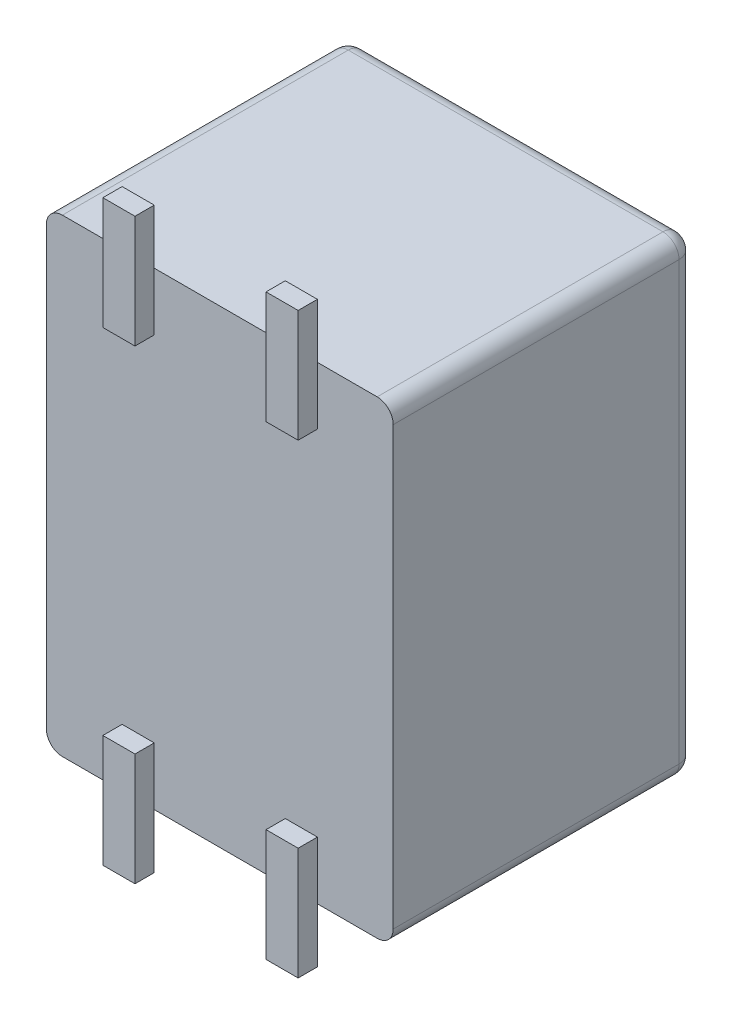
ISO-10303-21;
HEADER;
FILE_DESCRIPTION(('STEP AP214'),'2;1');
FILE_NAME('part.step','',(''),(''),'','','');
FILE_SCHEMA(('AUTOMOTIVE_DESIGN { 1 0 10303 214 1 1 1 1 }'));
ENDSEC;
DATA;
#1=APPLICATION_CONTEXT('core data for automotive mechanical design processes');
#2=APPLICATION_PROTOCOL_DEFINITION('international standard','automotive_design',2000,#1);
#3=PRODUCT_CONTEXT('',#1,'mechanical');
#4=PRODUCT('Part','Part','',(#3));
#5=PRODUCT_RELATED_PRODUCT_CATEGORY('part','',(#4));
#6=PRODUCT_DEFINITION_FORMATION('','',#4);
#7=PRODUCT_DEFINITION_CONTEXT('part definition',#1,'design');
#8=PRODUCT_DEFINITION('design','',#6,#7);
#9=PRODUCT_DEFINITION_SHAPE('','',#8);
#10=(LENGTH_UNIT() NAMED_UNIT(*) SI_UNIT(.MILLI.,.METRE.));
#11=(NAMED_UNIT(*) PLANE_ANGLE_UNIT() SI_UNIT($,.RADIAN.));
#12=(NAMED_UNIT(*) SI_UNIT($,.STERADIAN.) SOLID_ANGLE_UNIT());
#13=UNCERTAINTY_MEASURE_WITH_UNIT(LENGTH_MEASURE(1.E-05),#10,'distance_accuracy_value','');
#14=(GEOMETRIC_REPRESENTATION_CONTEXT(3) GLOBAL_UNCERTAINTY_ASSIGNED_CONTEXT((#13)) GLOBAL_UNIT_ASSIGNED_CONTEXT((#10,
#11,#12)) REPRESENTATION_CONTEXT('',''));
#15=CARTESIAN_POINT('',(0.,0.,0.));
#16=DIRECTION('',(0.,0.,1.));
#17=DIRECTION('',(1.,0.,0.));
#18=AXIS2_PLACEMENT_3D('',#15,#16,#17);
#19=CARTESIAN_POINT('',(-2.45,-3.4,-2.1));
#20=DIRECTION('',(0.,0.707106781186548,-0.707106781186548));
#21=DIRECTION('',(0.,-0.707106781186548,-0.707106781186548));
#22=AXIS2_PLACEMENT_3D('',#19,#20,#21);
#23=SPHERICAL_SURFACE('',#22,0.25);
#24=CARTESIAN_POINT('',(-2.45,-3.4,-2.1));
#25=DIRECTION('',(0.,0.,-1.));
#26=DIRECTION('',(0.,-1.,0.));
#27=AXIS2_PLACEMENT_3D('',#24,#25,#26);
#28=CIRCLE('',#27,0.25);
#29=CARTESIAN_POINT('',(-2.45,-3.65,-2.1));
#30=VERTEX_POINT('',#29);
#31=CARTESIAN_POINT('',(-2.7,-3.4,-2.1));
#32=VERTEX_POINT('',#31);
#33=EDGE_CURVE('E299',#30,#32,#28,.T.);
#34=ORIENTED_EDGE('',*,*,#33,.T.);
#35=CARTESIAN_POINT('',(-2.45,-3.4,-2.1));
#36=DIRECTION('',(0.,-1.,0.));
#37=DIRECTION('',(-1.,0.,0.));
#38=AXIS2_PLACEMENT_3D('',#35,#36,#37);
#39=CIRCLE('',#38,0.25);
#40=CARTESIAN_POINT('',(-2.45,-3.4,-2.35));
#41=VERTEX_POINT('',#40);
#42=EDGE_CURVE('E272',#32,#41,#39,.T.);
#43=ORIENTED_EDGE('',*,*,#42,.T.);
#44=CARTESIAN_POINT('',(-2.45,-3.4,-2.1));
#45=DIRECTION('',(-1.,0.,0.));
#46=DIRECTION('',(0.,0.,-1.));
#47=AXIS2_PLACEMENT_3D('',#44,#45,#46);
#48=CIRCLE('',#47,0.25);
#49=EDGE_CURVE('E11',#41,#30,#48,.T.);
#50=ORIENTED_EDGE('',*,*,#49,.T.);
#51=EDGE_LOOP('',(#34,#43,#50));
#52=FACE_BOUND('',#51,.T.);
#53=ADVANCED_FACE('F16',(#52),#23,.T.);
#54=CARTESIAN_POINT('',(9.73944,-3.4,-2.1));
#55=DIRECTION('',(1.,0.,0.));
#56=DIRECTION('',(0.,0.,-1.));
#57=AXIS2_PLACEMENT_3D('',#54,#55,#56);
#58=CYLINDRICAL_SURFACE('',#57,0.25);
#59=CARTESIAN_POINT('',(2.45,-3.4,-2.1));
#60=DIRECTION('',(1.,0.,0.));
#61=DIRECTION('',(0.,-1.,0.));
#62=AXIS2_PLACEMENT_3D('',#59,#60,#61);
#63=CIRCLE('',#62,0.25);
#64=CARTESIAN_POINT('',(2.45,-3.65,-2.1));
#65=VERTEX_POINT('',#64);
#66=CARTESIAN_POINT('',(2.45,-3.4,-2.35));
#67=VERTEX_POINT('',#66);
#68=EDGE_CURVE('E26',#65,#67,#63,.T.);
#69=ORIENTED_EDGE('',*,*,#68,.F.);
#70=DIRECTION('',(-1.,0.,0.));
#71=VECTOR('',#70,1.);
#72=CARTESIAN_POINT('',(2.45,-3.65,-2.1));
#73=LINE('',#72,#71);
#74=EDGE_CURVE('E338',#65,#30,#73,.T.);
#75=ORIENTED_EDGE('',*,*,#74,.T.);
#76=ORIENTED_EDGE('',*,*,#49,.F.);
#77=DIRECTION('',(-1.,0.,0.));
#78=VECTOR('',#77,1.);
#79=CARTESIAN_POINT('',(2.45,-3.4,-2.35));
#80=LINE('',#79,#78);
#81=EDGE_CURVE('E310',#67,#41,#80,.T.);
#82=ORIENTED_EDGE('',*,*,#81,.F.);
#83=EDGE_LOOP('',(#69,#75,#76,#82));
#84=FACE_BOUND('',#83,.T.);
#85=ADVANCED_FACE('F848',(#84),#58,.T.);
#86=CARTESIAN_POINT('',(2.45,-3.4,-2.1));
#87=DIRECTION('',(-0.707106781186548,0.,-0.707106781186548));
#88=DIRECTION('',(0.707106781186548,0.,-0.707106781186548));
#89=AXIS2_PLACEMENT_3D('',#86,#87,#88);
#90=SPHERICAL_SURFACE('',#89,0.25);
#91=ORIENTED_EDGE('',*,*,#68,.T.);
#92=CARTESIAN_POINT('',(2.45,-3.4,-2.1));
#93=DIRECTION('',(0.,-1.,0.));
#94=DIRECTION('',(0.,0.,-1.));
#95=AXIS2_PLACEMENT_3D('',#92,#93,#94);
#96=CIRCLE('',#95,0.25);
#97=CARTESIAN_POINT('',(2.7,-3.4,-2.1));
#98=VERTEX_POINT('',#97);
#99=EDGE_CURVE('E396',#67,#98,#96,.T.);
#100=ORIENTED_EDGE('',*,*,#99,.T.);
#101=CARTESIAN_POINT('',(2.45,-3.4,-2.1));
#102=DIRECTION('',(0.,0.,-1.));
#103=DIRECTION('',(1.,0.,0.));
#104=AXIS2_PLACEMENT_3D('',#101,#102,#103);
#105=CIRCLE('',#104,0.25);
#106=EDGE_CURVE('E440',#98,#65,#105,.T.);
#107=ORIENTED_EDGE('',*,*,#106,.T.);
#108=EDGE_LOOP('',(#91,#100,#107));
#109=FACE_BOUND('',#108,.T.);
#110=ADVANCED_FACE('F852',(#109),#90,.T.);
#111=CARTESIAN_POINT('',(2.45,-3.4,9.168));
#112=DIRECTION('',(0.,0.,1.));
#113=DIRECTION('',(1.,0.,0.));
#114=AXIS2_PLACEMENT_3D('',#111,#112,#113);
#115=CYLINDRICAL_SURFACE('',#114,0.25);
#116=DIRECTION('',(0.,0.,-1.));
#117=VECTOR('',#116,1.);
#118=CARTESIAN_POINT('',(2.45,-3.65,2.35));
#119=LINE('',#118,#117);
#120=CARTESIAN_POINT('',(2.45,-3.65,2.35));
#121=VERTEX_POINT('',#120);
#122=EDGE_CURVE('E341',#121,#65,#119,.T.);
#123=ORIENTED_EDGE('',*,*,#122,.T.);
#124=ORIENTED_EDGE('',*,*,#106,.F.);
#125=DIRECTION('',(0.,0.,-1.));
#126=VECTOR('',#125,1.);
#127=CARTESIAN_POINT('',(2.7,-3.4,2.35));
#128=LINE('',#127,#126);
#129=CARTESIAN_POINT('',(2.7,-3.4,2.35));
#130=VERTEX_POINT('',#129);
#131=EDGE_CURVE('E353',#130,#98,#128,.T.);
#132=ORIENTED_EDGE('',*,*,#131,.F.);
#133=CARTESIAN_POINT('',(2.45,-3.4,2.35));
#134=DIRECTION('',(0.,0.,1.));
#135=DIRECTION('',(0.,-1.,0.));
#136=AXIS2_PLACEMENT_3D('',#133,#134,#135);
#137=CIRCLE('',#136,0.25);
#138=EDGE_CURVE('E265',#121,#130,#137,.T.);
#139=ORIENTED_EDGE('',*,*,#138,.F.);
#140=EDGE_LOOP('',(#123,#124,#132,#139));
#141=FACE_BOUND('',#140,.T.);
#142=ADVANCED_FACE('F778',(#141),#115,.T.);
#143=CARTESIAN_POINT('',(-2.7,-3.65,2.35));
#144=DIRECTION('',(0.,-1.,0.));
#145=DIRECTION('',(0.,0.,-1.));
#146=AXIS2_PLACEMENT_3D('',#143,#144,#145);
#147=PLANE('',#146);
#148=ORIENTED_EDGE('',*,*,#74,.F.);
#149=ORIENTED_EDGE('',*,*,#122,.F.);
#150=DIRECTION('',(1.,0.,0.));
#151=VECTOR('',#150,1.);
#152=CARTESIAN_POINT('',(1.52,-3.65,2.35));
#153=LINE('',#152,#151);
#154=CARTESIAN_POINT('',(1.52,-3.65,2.35));
#155=VERTEX_POINT('',#154);
#156=EDGE_CURVE('E343',#155,#121,#153,.T.);
#157=ORIENTED_EDGE('',*,*,#156,.F.);
#158=DIRECTION('',(1.,0.,0.));
#159=VECTOR('',#158,1.);
#160=CARTESIAN_POINT('',(1.02,-3.65,2.35));
#161=LINE('',#160,#159);
#162=CARTESIAN_POINT('',(1.02,-3.65,2.35));
#163=VERTEX_POINT('',#162);
#164=EDGE_CURVE('E267',#163,#155,#161,.T.);
#165=ORIENTED_EDGE('',*,*,#164,.F.);
#166=DIRECTION('',(1.,0.,0.));
#167=VECTOR('',#166,1.);
#168=CARTESIAN_POINT('',(-1.02,-3.65,2.35));
#169=LINE('',#168,#167);
#170=CARTESIAN_POINT('',(-1.02,-3.65,2.35));
#171=VERTEX_POINT('',#170);
#172=EDGE_CURVE('E411',#171,#163,#169,.T.);
#173=ORIENTED_EDGE('',*,*,#172,.F.);
#174=DIRECTION('',(1.,0.,0.));
#175=VECTOR('',#174,1.);
#176=CARTESIAN_POINT('',(-1.52,-3.65,2.35));
#177=LINE('',#176,#175);
#178=CARTESIAN_POINT('',(-1.52,-3.65,2.35));
#179=VERTEX_POINT('',#178);
#180=EDGE_CURVE('E402',#179,#171,#177,.T.);
#181=ORIENTED_EDGE('',*,*,#180,.F.);
#182=DIRECTION('',(1.,0.,0.));
#183=VECTOR('',#182,1.);
#184=CARTESIAN_POINT('',(-2.45,-3.65,2.35));
#185=LINE('',#184,#183);
#186=CARTESIAN_POINT('',(-2.45,-3.65,2.35));
#187=VERTEX_POINT('',#186);
#188=EDGE_CURVE('E305',#187,#179,#185,.T.);
#189=ORIENTED_EDGE('',*,*,#188,.F.);
#190=DIRECTION('',(0.,0.,1.));
#191=VECTOR('',#190,1.);
#192=CARTESIAN_POINT('',(-2.45,-3.65,-2.1));
#193=LINE('',#192,#191);
#194=EDGE_CURVE('E302',#30,#187,#193,.T.);
#195=ORIENTED_EDGE('',*,*,#194,.F.);
#196=EDGE_LOOP('',(#148,#149,#157,#165,#173,#181,#189,#195));
#197=FACE_BOUND('',#196,.T.);
#198=ADVANCED_FACE('F696',(#197),#147,.T.);
#199=CARTESIAN_POINT('',(-1.52,-4.5,2.35));
#200=DIRECTION('',(0.,-1.,0.));
#201=DIRECTION('',(0.,0.,-1.));
#202=AXIS2_PLACEMENT_3D('',#199,#200,#201);
#203=PLANE('',#202);
#204=DIRECTION('',(0.,0.,1.));
#205=VECTOR('',#204,1.);
#206=CARTESIAN_POINT('',(-1.02,-4.5,2.35));
#207=LINE('',#206,#205);
#208=CARTESIAN_POINT('',(-1.02,-4.5,2.35));
#209=VERTEX_POINT('',#208);
#210=CARTESIAN_POINT('',(-1.02,-4.5,2.65));
#211=VERTEX_POINT('',#210);
#212=EDGE_CURVE('E342',#209,#211,#207,.T.);
#213=ORIENTED_EDGE('',*,*,#212,.T.);
#214=DIRECTION('',(1.,0.,0.));
#215=VECTOR('',#214,1.);
#216=CARTESIAN_POINT('',(-1.52,-4.5,2.65));
#217=LINE('',#216,#215);
#218=CARTESIAN_POINT('',(-1.52,-4.5,2.65));
#219=VERTEX_POINT('',#218);
#220=EDGE_CURVE('E284',#219,#211,#217,.T.);
#221=ORIENTED_EDGE('',*,*,#220,.F.);
#222=DIRECTION('',(0.,0.,1.));
#223=VECTOR('',#222,1.);
#224=CARTESIAN_POINT('',(-1.52,-4.5,2.35));
#225=LINE('',#224,#223);
#226=CARTESIAN_POINT('',(-1.52,-4.5,2.35));
#227=VERTEX_POINT('',#226);
#228=EDGE_CURVE('E505',#227,#219,#225,.T.);
#229=ORIENTED_EDGE('',*,*,#228,.F.);
#230=DIRECTION('',(1.,0.,0.));
#231=VECTOR('',#230,1.);
#232=CARTESIAN_POINT('',(-1.52,-4.5,2.35));
#233=LINE('',#232,#231);
#234=EDGE_CURVE('E511',#227,#209,#233,.T.);
#235=ORIENTED_EDGE('',*,*,#234,.T.);
#236=EDGE_LOOP('',(#213,#221,#229,#235));
#237=FACE_BOUND('',#236,.T.);
#238=ADVANCED_FACE('F675',(#237),#203,.T.);
#239=CARTESIAN_POINT('',(-1.02,-4.5,2.35));
#240=DIRECTION('',(1.,0.,0.));
#241=DIRECTION('',(0.,1.,0.));
#242=AXIS2_PLACEMENT_3D('',#239,#240,#241);
#243=PLANE('',#242);
#244=DIRECTION('',(0.,0.,1.));
#245=VECTOR('',#244,1.);
#246=CARTESIAN_POINT('',(-1.02,-2.75,2.35));
#247=LINE('',#246,#245);
#248=CARTESIAN_POINT('',(-1.02,-2.75,2.35));
#249=VERTEX_POINT('',#248);
#250=CARTESIAN_POINT('',(-1.02,-2.75,2.65));
#251=VERTEX_POINT('',#250);
#252=EDGE_CURVE('E382',#249,#251,#247,.T.);
#253=ORIENTED_EDGE('',*,*,#252,.T.);
#254=DIRECTION('',(0.,1.,0.));
#255=VECTOR('',#254,1.);
#256=CARTESIAN_POINT('',(-1.02,-4.5,2.65));
#257=LINE('',#256,#255);
#258=EDGE_CURVE('E288',#211,#251,#257,.T.);
#259=ORIENTED_EDGE('',*,*,#258,.F.);
#260=ORIENTED_EDGE('',*,*,#212,.F.);
#261=DIRECTION('',(0.,1.,0.));
#262=VECTOR('',#261,1.);
#263=CARTESIAN_POINT('',(-1.02,-4.5,2.35));
#264=LINE('',#263,#262);
#265=EDGE_CURVE('E460',#209,#171,#264,.T.);
#266=ORIENTED_EDGE('',*,*,#265,.T.);
#267=DIRECTION('',(0.,1.,0.));
#268=VECTOR('',#267,1.);
#269=CARTESIAN_POINT('',(-1.02,-3.65,2.35));
#270=LINE('',#269,#268);
#271=EDGE_CURVE('E452',#171,#249,#270,.T.);
#272=ORIENTED_EDGE('',*,*,#271,.T.);
#273=EDGE_LOOP('',(#253,#259,#260,#266,#272));
#274=FACE_BOUND('',#273,.T.);
#275=ADVANCED_FACE('F679',(#274),#243,.T.);
#276=CARTESIAN_POINT('',(-1.02,-2.75,2.35));
#277=DIRECTION('',(0.,1.,0.));
#278=DIRECTION('',(1.,0.,0.));
#279=AXIS2_PLACEMENT_3D('',#276,#277,#278);
#280=PLANE('',#279);
#281=DIRECTION('',(0.,0.,1.));
#282=VECTOR('',#281,1.);
#283=CARTESIAN_POINT('',(-1.52,-2.75,2.35));
#284=LINE('',#283,#282);
#285=CARTESIAN_POINT('',(-1.52,-2.75,2.35));
#286=VERTEX_POINT('',#285);
#287=CARTESIAN_POINT('',(-1.52,-2.75,2.65));
#288=VERTEX_POINT('',#287);
#289=EDGE_CURVE('E19',#286,#288,#284,.T.);
#290=ORIENTED_EDGE('',*,*,#289,.T.);
#291=DIRECTION('',(-1.,0.,0.));
#292=VECTOR('',#291,1.);
#293=CARTESIAN_POINT('',(-1.02,-2.75,2.65));
#294=LINE('',#293,#292);
#295=EDGE_CURVE('E329',#251,#288,#294,.T.);
#296=ORIENTED_EDGE('',*,*,#295,.F.);
#297=ORIENTED_EDGE('',*,*,#252,.F.);
#298=DIRECTION('',(-1.,0.,0.));
#299=VECTOR('',#298,1.);
#300=CARTESIAN_POINT('',(-1.02,-2.75,2.35));
#301=LINE('',#300,#299);
#302=EDGE_CURVE('E574',#249,#286,#301,.T.);
#303=ORIENTED_EDGE('',*,*,#302,.T.);
#304=EDGE_LOOP('',(#290,#296,#297,#303));
#305=FACE_BOUND('',#304,.T.);
#306=ADVANCED_FACE('F703',(#305),#280,.T.);
#307=CARTESIAN_POINT('',(-1.52,-2.75,2.35));
#308=DIRECTION('',(-1.,0.,0.));
#309=DIRECTION('',(0.,0.,1.));
#310=AXIS2_PLACEMENT_3D('',#307,#308,#309);
#311=PLANE('',#310);
#312=DIRECTION('',(0.,-1.,0.));
#313=VECTOR('',#312,1.);
#314=CARTESIAN_POINT('',(-1.52,-3.65,2.35));
#315=LINE('',#314,#313);
#316=EDGE_CURVE('E468',#179,#227,#315,.T.);
#317=ORIENTED_EDGE('',*,*,#316,.T.);
#318=ORIENTED_EDGE('',*,*,#228,.T.);
#319=DIRECTION('',(0.,-1.,0.));
#320=VECTOR('',#319,1.);
#321=CARTESIAN_POINT('',(-1.52,-2.75,2.65));
#322=LINE('',#321,#320);
#323=EDGE_CURVE('E475',#288,#219,#322,.T.);
#324=ORIENTED_EDGE('',*,*,#323,.F.);
#325=ORIENTED_EDGE('',*,*,#289,.F.);
#326=DIRECTION('',(0.,1.,0.));
#327=VECTOR('',#326,1.);
#328=CARTESIAN_POINT('',(-1.52,-3.65,2.35));
#329=LINE('',#328,#327);
#330=EDGE_CURVE('E308',#179,#286,#329,.T.);
#331=ORIENTED_EDGE('',*,*,#330,.F.);
#332=EDGE_LOOP('',(#317,#318,#324,#325,#331));
#333=FACE_BOUND('',#332,.T.);
#334=ADVANCED_FACE('F686',(#333),#311,.T.);
#335=CARTESIAN_POINT('',(1.52,4.5,2.35));
#336=DIRECTION('',(0.,1.,0.));
#337=DIRECTION('',(1.,0.,0.));
#338=AXIS2_PLACEMENT_3D('',#335,#336,#337);
#339=PLANE('',#338);
#340=DIRECTION('',(0.,0.,1.));
#341=VECTOR('',#340,1.);
#342=CARTESIAN_POINT('',(1.02,4.5,2.35));
#343=LINE('',#342,#341);
#344=CARTESIAN_POINT('',(1.02,4.5,2.35));
#345=VERTEX_POINT('',#344);
#346=CARTESIAN_POINT('',(1.02,4.5,2.65));
#347=VERTEX_POINT('',#346);
#348=EDGE_CURVE('E153',#345,#347,#343,.T.);
#349=ORIENTED_EDGE('',*,*,#348,.T.);
#350=DIRECTION('',(-1.,0.,0.));
#351=VECTOR('',#350,1.);
#352=CARTESIAN_POINT('',(1.52,4.5,2.65));
#353=LINE('',#352,#351);
#354=CARTESIAN_POINT('',(1.52,4.5,2.65));
#355=VERTEX_POINT('',#354);
#356=EDGE_CURVE('E333',#355,#347,#353,.T.);
#357=ORIENTED_EDGE('',*,*,#356,.F.);
#358=DIRECTION('',(0.,0.,1.));
#359=VECTOR('',#358,1.);
#360=CARTESIAN_POINT('',(1.52,4.5,2.35));
#361=LINE('',#360,#359);
#362=CARTESIAN_POINT('',(1.52,4.5,2.35));
#363=VERTEX_POINT('',#362);
#364=EDGE_CURVE('E141',#363,#355,#361,.T.);
#365=ORIENTED_EDGE('',*,*,#364,.F.);
#366=DIRECTION('',(-1.,0.,0.));
#367=VECTOR('',#366,1.);
#368=CARTESIAN_POINT('',(1.52,4.5,2.35));
#369=LINE('',#368,#367);
#370=EDGE_CURVE('E461',#363,#345,#369,.T.);
#371=ORIENTED_EDGE('',*,*,#370,.T.);
#372=EDGE_LOOP('',(#349,#357,#365,#371));
#373=FACE_BOUND('',#372,.T.);
#374=ADVANCED_FACE('F763',(#373),#339,.T.);
#375=CARTESIAN_POINT('',(1.02,4.5,2.35));
#376=DIRECTION('',(-1.,0.,0.));
#377=DIRECTION('',(0.,0.,1.));
#378=AXIS2_PLACEMENT_3D('',#375,#376,#377);
#379=PLANE('',#378);
#380=DIRECTION('',(0.,0.,1.));
#381=VECTOR('',#380,1.);
#382=CARTESIAN_POINT('',(1.02,2.75,2.35));
#383=LINE('',#382,#381);
#384=CARTESIAN_POINT('',(1.02,2.75,2.35));
#385=VERTEX_POINT('',#384);
#386=CARTESIAN_POINT('',(1.02,2.75,2.65));
#387=VERTEX_POINT('',#386);
#388=EDGE_CURVE('E238',#385,#387,#383,.T.);
#389=ORIENTED_EDGE('',*,*,#388,.T.);
#390=DIRECTION('',(0.,-1.,0.));
#391=VECTOR('',#390,1.);
#392=CARTESIAN_POINT('',(1.02,4.5,2.65));
#393=LINE('',#392,#391);
#394=EDGE_CURVE('E325',#347,#387,#393,.T.);
#395=ORIENTED_EDGE('',*,*,#394,.F.);
#396=ORIENTED_EDGE('',*,*,#348,.F.);
#397=DIRECTION('',(0.,-1.,0.));
#398=VECTOR('',#397,1.);
#399=CARTESIAN_POINT('',(1.02,4.5,2.35));
#400=LINE('',#399,#398);
#401=CARTESIAN_POINT('',(1.02,3.65,2.35));
#402=VERTEX_POINT('',#401);
#403=EDGE_CURVE('E462',#345,#402,#400,.T.);
#404=ORIENTED_EDGE('',*,*,#403,.T.);
#405=DIRECTION('',(0.,-1.,0.));
#406=VECTOR('',#405,1.);
#407=CARTESIAN_POINT('',(1.02,3.65,2.35));
#408=LINE('',#407,#406);
#409=EDGE_CURVE('E248',#402,#385,#408,.T.);
#410=ORIENTED_EDGE('',*,*,#409,.T.);
#411=EDGE_LOOP('',(#389,#395,#396,#404,#410));
#412=FACE_BOUND('',#411,.T.);
#413=ADVANCED_FACE('F804',(#412),#379,.T.);
#414=CARTESIAN_POINT('',(1.02,2.75,2.35));
#415=DIRECTION('',(0.,-1.,0.));
#416=DIRECTION('',(0.,0.,-1.));
#417=AXIS2_PLACEMENT_3D('',#414,#415,#416);
#418=PLANE('',#417);
#419=DIRECTION('',(0.,0.,1.));
#420=VECTOR('',#419,1.);
#421=CARTESIAN_POINT('',(1.52,2.75,2.35));
#422=LINE('',#421,#420);
#423=CARTESIAN_POINT('',(1.52,2.75,2.35));
#424=VERTEX_POINT('',#423);
#425=CARTESIAN_POINT('',(1.52,2.75,2.65));
#426=VERTEX_POINT('',#425);
#427=EDGE_CURVE('E226',#424,#426,#422,.T.);
#428=ORIENTED_EDGE('',*,*,#427,.T.);
#429=DIRECTION('',(1.,0.,0.));
#430=VECTOR('',#429,1.);
#431=CARTESIAN_POINT('',(1.02,2.75,2.65));
#432=LINE('',#431,#430);
#433=EDGE_CURVE('E322',#387,#426,#432,.T.);
#434=ORIENTED_EDGE('',*,*,#433,.F.);
#435=ORIENTED_EDGE('',*,*,#388,.F.);
#436=DIRECTION('',(1.,0.,0.));
#437=VECTOR('',#436,1.);
#438=CARTESIAN_POINT('',(1.02,2.75,2.35));
#439=LINE('',#438,#437);
#440=EDGE_CURVE('E241',#385,#424,#439,.T.);
#441=ORIENTED_EDGE('',*,*,#440,.T.);
#442=EDGE_LOOP('',(#428,#434,#435,#441));
#443=FACE_BOUND('',#442,.T.);
#444=ADVANCED_FACE('F242',(#443),#418,.T.);
#445=CARTESIAN_POINT('',(1.52,2.75,2.35));
#446=DIRECTION('',(1.,0.,0.));
#447=DIRECTION('',(0.,1.,0.));
#448=AXIS2_PLACEMENT_3D('',#445,#446,#447);
#449=PLANE('',#448);
#450=DIRECTION('',(0.,1.,0.));
#451=VECTOR('',#450,1.);
#452=CARTESIAN_POINT('',(1.52,3.65,2.35));
#453=LINE('',#452,#451);
#454=CARTESIAN_POINT('',(1.52,3.65,2.35));
#455=VERTEX_POINT('',#454);
#456=EDGE_CURVE('E457',#455,#363,#453,.T.);
#457=ORIENTED_EDGE('',*,*,#456,.T.);
#458=ORIENTED_EDGE('',*,*,#364,.T.);
#459=DIRECTION('',(0.,1.,0.));
#460=VECTOR('',#459,1.);
#461=CARTESIAN_POINT('',(1.52,2.75,2.65));
#462=LINE('',#461,#460);
#463=EDGE_CURVE('E233',#426,#355,#462,.T.);
#464=ORIENTED_EDGE('',*,*,#463,.F.);
#465=ORIENTED_EDGE('',*,*,#427,.F.);
#466=DIRECTION('',(0.,-1.,0.));
#467=VECTOR('',#466,1.);
#468=CARTESIAN_POINT('',(1.52,3.65,2.35));
#469=LINE('',#468,#467);
#470=EDGE_CURVE('E230',#455,#424,#469,.T.);
#471=ORIENTED_EDGE('',*,*,#470,.F.);
#472=EDGE_LOOP('',(#457,#458,#464,#465,#471));
#473=FACE_BOUND('',#472,.T.);
#474=ADVANCED_FACE('F228',(#473),#449,.T.);
#475=CARTESIAN_POINT('',(1.02,-2.75,2.35));
#476=DIRECTION('',(-1.,0.,0.));
#477=DIRECTION('',(0.,0.,1.));
#478=AXIS2_PLACEMENT_3D('',#475,#476,#477);
#479=PLANE('',#478);
#480=DIRECTION('',(0.,-1.,0.));
#481=VECTOR('',#480,1.);
#482=CARTESIAN_POINT('',(1.02,-3.65,2.35));
#483=LINE('',#482,#481);
#484=CARTESIAN_POINT('',(1.02,-4.5,2.35));
#485=VERTEX_POINT('',#484);
#486=EDGE_CURVE('E271',#163,#485,#483,.T.);
#487=ORIENTED_EDGE('',*,*,#486,.T.);
#488=DIRECTION('',(0.,0.,1.));
#489=VECTOR('',#488,1.);
#490=CARTESIAN_POINT('',(1.02,-4.5,2.35));
#491=LINE('',#490,#489);
#492=CARTESIAN_POINT('',(1.02,-4.5,2.65));
#493=VERTEX_POINT('',#492);
#494=EDGE_CURVE('E334',#485,#493,#491,.T.);
#495=ORIENTED_EDGE('',*,*,#494,.T.);
#496=DIRECTION('',(0.,-1.,0.));
#497=VECTOR('',#496,1.);
#498=CARTESIAN_POINT('',(1.02,-2.75,2.65));
#499=LINE('',#498,#497);
#500=CARTESIAN_POINT('',(1.02,-2.75,2.65));
#501=VERTEX_POINT('',#500);
#502=EDGE_CURVE('E278',#501,#493,#499,.T.);
#503=ORIENTED_EDGE('',*,*,#502,.F.);
#504=DIRECTION('',(0.,0.,1.));
#505=VECTOR('',#504,1.);
#506=CARTESIAN_POINT('',(1.02,-2.75,2.35));
#507=LINE('',#506,#505);
#508=CARTESIAN_POINT('',(1.02,-2.75,2.35));
#509=VERTEX_POINT('',#508);
#510=EDGE_CURVE('E550',#509,#501,#507,.T.);
#511=ORIENTED_EDGE('',*,*,#510,.F.);
#512=DIRECTION('',(0.,1.,0.));
#513=VECTOR('',#512,1.);
#514=CARTESIAN_POINT('',(1.02,-3.65,2.35));
#515=LINE('',#514,#513);
#516=EDGE_CURVE('E406',#163,#509,#515,.T.);
#517=ORIENTED_EDGE('',*,*,#516,.F.);
#518=EDGE_LOOP('',(#487,#495,#503,#511,#517));
#519=FACE_BOUND('',#518,.T.);
#520=ADVANCED_FACE('F725',(#519),#479,.T.);
#521=CARTESIAN_POINT('',(1.02,-4.5,2.35));
#522=DIRECTION('',(0.,-1.,0.));
#523=DIRECTION('',(0.,0.,-1.));
#524=AXIS2_PLACEMENT_3D('',#521,#522,#523);
#525=PLANE('',#524);
#526=DIRECTION('',(0.,0.,1.));
#527=VECTOR('',#526,1.);
#528=CARTESIAN_POINT('',(1.52,-4.5,2.35));
#529=LINE('',#528,#527);
#530=CARTESIAN_POINT('',(1.52,-4.5,2.35));
#531=VERTEX_POINT('',#530);
#532=CARTESIAN_POINT('',(1.52,-4.5,2.65));
#533=VERTEX_POINT('',#532);
#534=EDGE_CURVE('E336',#531,#533,#529,.T.);
#535=ORIENTED_EDGE('',*,*,#534,.T.);
#536=DIRECTION('',(1.,0.,0.));
#537=VECTOR('',#536,1.);
#538=CARTESIAN_POINT('',(1.02,-4.5,2.65));
#539=LINE('',#538,#537);
#540=EDGE_CURVE('E282',#493,#533,#539,.T.);
#541=ORIENTED_EDGE('',*,*,#540,.F.);
#542=ORIENTED_EDGE('',*,*,#494,.F.);
#543=DIRECTION('',(1.,0.,0.));
#544=VECTOR('',#543,1.);
#545=CARTESIAN_POINT('',(1.02,-4.5,2.35));
#546=LINE('',#545,#544);
#547=EDGE_CURVE('E401',#485,#531,#546,.T.);
#548=ORIENTED_EDGE('',*,*,#547,.T.);
#549=EDGE_LOOP('',(#535,#541,#542,#548));
#550=FACE_BOUND('',#549,.T.);
#551=ADVANCED_FACE('F720',(#550),#525,.T.);
#552=CARTESIAN_POINT('',(1.52,-4.5,2.35));
#553=DIRECTION('',(1.,0.,0.));
#554=DIRECTION('',(0.,1.,0.));
#555=AXIS2_PLACEMENT_3D('',#552,#553,#554);
#556=PLANE('',#555);
#557=DIRECTION('',(0.,0.,1.));
#558=VECTOR('',#557,1.);
#559=CARTESIAN_POINT('',(1.52,-2.75,2.35));
#560=LINE('',#559,#558);
#561=CARTESIAN_POINT('',(1.52,-2.75,2.35));
#562=VERTEX_POINT('',#561);
#563=CARTESIAN_POINT('',(1.52,-2.75,2.65));
#564=VERTEX_POINT('',#563);
#565=EDGE_CURVE('E553',#562,#564,#560,.T.);
#566=ORIENTED_EDGE('',*,*,#565,.T.);
#567=DIRECTION('',(0.,1.,0.));
#568=VECTOR('',#567,1.);
#569=CARTESIAN_POINT('',(1.52,-4.5,2.65));
#570=LINE('',#569,#568);
#571=EDGE_CURVE('E456',#533,#564,#570,.T.);
#572=ORIENTED_EDGE('',*,*,#571,.F.);
#573=ORIENTED_EDGE('',*,*,#534,.F.);
#574=DIRECTION('',(0.,1.,0.));
#575=VECTOR('',#574,1.);
#576=CARTESIAN_POINT('',(1.52,-4.5,2.35));
#577=LINE('',#576,#575);
#578=EDGE_CURVE('E397',#531,#155,#577,.T.);
#579=ORIENTED_EDGE('',*,*,#578,.T.);
#580=DIRECTION('',(0.,1.,0.));
#581=VECTOR('',#580,1.);
#582=CARTESIAN_POINT('',(1.52,-3.65,2.35));
#583=LINE('',#582,#581);
#584=EDGE_CURVE('E347',#155,#562,#583,.T.);
#585=ORIENTED_EDGE('',*,*,#584,.T.);
#586=EDGE_LOOP('',(#566,#572,#573,#579,#585));
#587=FACE_BOUND('',#586,.T.);
#588=ADVANCED_FACE('F724',(#587),#556,.T.);
#589=CARTESIAN_POINT('',(1.52,-2.75,2.35));
#590=DIRECTION('',(0.,1.,0.));
#591=DIRECTION('',(1.,0.,0.));
#592=AXIS2_PLACEMENT_3D('',#589,#590,#591);
#593=PLANE('',#592);
#594=ORIENTED_EDGE('',*,*,#510,.T.);
#595=DIRECTION('',(-1.,0.,0.));
#596=VECTOR('',#595,1.);
#597=CARTESIAN_POINT('',(1.52,-2.75,2.65));
#598=LINE('',#597,#596);
#599=EDGE_CURVE('E362',#564,#501,#598,.T.);
#600=ORIENTED_EDGE('',*,*,#599,.F.);
#601=ORIENTED_EDGE('',*,*,#565,.F.);
#602=DIRECTION('',(-1.,0.,0.));
#603=VECTOR('',#602,1.);
#604=CARTESIAN_POINT('',(1.52,-2.75,2.35));
#605=LINE('',#604,#603);
#606=EDGE_CURVE('E410',#562,#509,#605,.T.);
#607=ORIENTED_EDGE('',*,*,#606,.T.);
#608=EDGE_LOOP('',(#594,#600,#601,#607));
#609=FACE_BOUND('',#608,.T.);
#610=ADVANCED_FACE('F832',(#609),#593,.T.);
#611=CARTESIAN_POINT('',(-2.7,0.,2.65));
#612=DIRECTION('',(0.,0.,1.));
#613=DIRECTION('',(1.,0.,0.));
#614=AXIS2_PLACEMENT_3D('',#611,#612,#613);
#615=PLANE('',#614);
#616=DIRECTION('',(0.,1.,0.));
#617=VECTOR('',#616,1.);
#618=CARTESIAN_POINT('',(-1.02,2.75,2.65));
#619=LINE('',#618,#617);
#620=CARTESIAN_POINT('',(-1.02,2.75,2.65));
#621=VERTEX_POINT('',#620);
#622=CARTESIAN_POINT('',(-1.02,4.5,2.65));
#623=VERTEX_POINT('',#622);
#624=EDGE_CURVE('E367',#621,#623,#619,.T.);
#625=ORIENTED_EDGE('',*,*,#624,.T.);
#626=DIRECTION('',(-1.,0.,0.));
#627=VECTOR('',#626,1.);
#628=CARTESIAN_POINT('',(-1.02,4.5,2.65));
#629=LINE('',#628,#627);
#630=CARTESIAN_POINT('',(-1.52,4.5,2.65));
#631=VERTEX_POINT('',#630);
#632=EDGE_CURVE('E283',#623,#631,#629,.T.);
#633=ORIENTED_EDGE('',*,*,#632,.T.);
#634=DIRECTION('',(0.,-1.,0.));
#635=VECTOR('',#634,1.);
#636=CARTESIAN_POINT('',(-1.52,4.5,2.65));
#637=LINE('',#636,#635);
#638=CARTESIAN_POINT('',(-1.52,2.75,2.65));
#639=VERTEX_POINT('',#638);
#640=EDGE_CURVE('E486',#631,#639,#637,.T.);
#641=ORIENTED_EDGE('',*,*,#640,.T.);
#642=DIRECTION('',(1.,0.,0.));
#643=VECTOR('',#642,1.);
#644=CARTESIAN_POINT('',(-1.52,2.75,2.65));
#645=LINE('',#644,#643);
#646=EDGE_CURVE('E429',#639,#621,#645,.T.);
#647=ORIENTED_EDGE('',*,*,#646,.T.);
#648=EDGE_LOOP('',(#625,#633,#641,#647));
#649=FACE_BOUND('',#648,.T.);
#650=ADVANCED_FACE('F636',(#649),#615,.T.);
#651=CARTESIAN_POINT('',(-2.7,0.,2.65));
#652=DIRECTION('',(0.,0.,1.));
#653=DIRECTION('',(1.,0.,0.));
#654=AXIS2_PLACEMENT_3D('',#651,#652,#653);
#655=PLANE('',#654);
#656=ORIENTED_EDGE('',*,*,#220,.T.);
#657=ORIENTED_EDGE('',*,*,#258,.T.);
#658=ORIENTED_EDGE('',*,*,#295,.T.);
#659=ORIENTED_EDGE('',*,*,#323,.T.);
#660=EDGE_LOOP('',(#656,#657,#658,#659));
#661=FACE_BOUND('',#660,.T.);
#662=ADVANCED_FACE('F683',(#661),#655,.T.);
#663=CARTESIAN_POINT('',(-2.7,0.,2.65));
#664=DIRECTION('',(0.,0.,1.));
#665=DIRECTION('',(1.,0.,0.));
#666=AXIS2_PLACEMENT_3D('',#663,#664,#665);
#667=PLANE('',#666);
#668=ORIENTED_EDGE('',*,*,#356,.T.);
#669=ORIENTED_EDGE('',*,*,#394,.T.);
#670=ORIENTED_EDGE('',*,*,#433,.T.);
#671=ORIENTED_EDGE('',*,*,#463,.T.);
#672=EDGE_LOOP('',(#668,#669,#670,#671));
#673=FACE_BOUND('',#672,.T.);
#674=ADVANCED_FACE('F869',(#673),#667,.T.);
#675=CARTESIAN_POINT('',(-2.7,0.,2.65));
#676=DIRECTION('',(0.,0.,1.));
#677=DIRECTION('',(1.,0.,0.));
#678=AXIS2_PLACEMENT_3D('',#675,#676,#677);
#679=PLANE('',#678);
#680=ORIENTED_EDGE('',*,*,#502,.T.);
#681=ORIENTED_EDGE('',*,*,#540,.T.);
#682=ORIENTED_EDGE('',*,*,#571,.T.);
#683=ORIENTED_EDGE('',*,*,#599,.T.);
#684=EDGE_LOOP('',(#680,#681,#682,#683));
#685=FACE_BOUND('',#684,.T.);
#686=ADVANCED_FACE('F865',(#685),#679,.T.);
#687=CARTESIAN_POINT('',(-1.02,4.5,2.35));
#688=DIRECTION('',(0.,1.,0.));
#689=DIRECTION('',(1.,0.,0.));
#690=AXIS2_PLACEMENT_3D('',#687,#688,#689);
#691=PLANE('',#690);
#692=DIRECTION('',(0.,0.,1.));
#693=VECTOR('',#692,1.);
#694=CARTESIAN_POINT('',(-1.52,4.5,2.35));
#695=LINE('',#694,#693);
#696=CARTESIAN_POINT('',(-1.52,4.5,2.35));
#697=VERTEX_POINT('',#696);
#698=EDGE_CURVE('E422',#697,#631,#695,.T.);
#699=ORIENTED_EDGE('',*,*,#698,.T.);
#700=ORIENTED_EDGE('',*,*,#632,.F.);
#701=DIRECTION('',(0.,0.,1.));
#702=VECTOR('',#701,1.);
#703=CARTESIAN_POINT('',(-1.02,4.5,2.35));
#704=LINE('',#703,#702);
#705=CARTESIAN_POINT('',(-1.02,4.5,2.35));
#706=VERTEX_POINT('',#705);
#707=EDGE_CURVE('E270',#706,#623,#704,.T.);
#708=ORIENTED_EDGE('',*,*,#707,.F.);
#709=DIRECTION('',(-1.,0.,0.));
#710=VECTOR('',#709,1.);
#711=CARTESIAN_POINT('',(-1.02,4.5,2.35));
#712=LINE('',#711,#710);
#713=EDGE_CURVE('E496',#706,#697,#712,.T.);
#714=ORIENTED_EDGE('',*,*,#713,.T.);
#715=EDGE_LOOP('',(#699,#700,#708,#714));
#716=FACE_BOUND('',#715,.T.);
#717=ADVANCED_FACE('F639',(#716),#691,.T.);
#718=CARTESIAN_POINT('',(-1.52,4.5,2.35));
#719=DIRECTION('',(-1.,0.,0.));
#720=DIRECTION('',(0.,0.,1.));
#721=AXIS2_PLACEMENT_3D('',#718,#719,#720);
#722=PLANE('',#721);
#723=DIRECTION('',(0.,0.,1.));
#724=VECTOR('',#723,1.);
#725=CARTESIAN_POINT('',(-1.52,2.75,2.35));
#726=LINE('',#725,#724);
#727=CARTESIAN_POINT('',(-1.52,2.75,2.35));
#728=VERTEX_POINT('',#727);
#729=EDGE_CURVE('E432',#728,#639,#726,.T.);
#730=ORIENTED_EDGE('',*,*,#729,.T.);
#731=ORIENTED_EDGE('',*,*,#640,.F.);
#732=ORIENTED_EDGE('',*,*,#698,.F.);
#733=DIRECTION('',(0.,-1.,0.));
#734=VECTOR('',#733,1.);
#735=CARTESIAN_POINT('',(-1.52,4.5,2.35));
#736=LINE('',#735,#734);
#737=CARTESIAN_POINT('',(-1.52,3.65,2.35));
#738=VERTEX_POINT('',#737);
#739=EDGE_CURVE('E447',#697,#738,#736,.T.);
#740=ORIENTED_EDGE('',*,*,#739,.T.);
#741=DIRECTION('',(0.,-1.,0.));
#742=VECTOR('',#741,1.);
#743=CARTESIAN_POINT('',(-1.52,3.65,2.35));
#744=LINE('',#743,#742);
#745=EDGE_CURVE('E375',#738,#728,#744,.T.);
#746=ORIENTED_EDGE('',*,*,#745,.T.);
#747=EDGE_LOOP('',(#730,#731,#732,#740,#746));
#748=FACE_BOUND('',#747,.T.);
#749=ADVANCED_FACE('F613',(#748),#722,.T.);
#750=CARTESIAN_POINT('',(-1.52,2.75,2.35));
#751=DIRECTION('',(0.,-1.,0.));
#752=DIRECTION('',(0.,0.,-1.));
#753=AXIS2_PLACEMENT_3D('',#750,#751,#752);
#754=PLANE('',#753);
#755=DIRECTION('',(0.,0.,1.));
#756=VECTOR('',#755,1.);
#757=CARTESIAN_POINT('',(-1.02,2.75,2.35));
#758=LINE('',#757,#756);
#759=CARTESIAN_POINT('',(-1.02,2.75,2.35));
#760=VERTEX_POINT('',#759);
#761=EDGE_CURVE('E371',#760,#621,#758,.T.);
#762=ORIENTED_EDGE('',*,*,#761,.T.);
#763=ORIENTED_EDGE('',*,*,#646,.F.);
#764=ORIENTED_EDGE('',*,*,#729,.F.);
#765=DIRECTION('',(1.,0.,0.));
#766=VECTOR('',#765,1.);
#767=CARTESIAN_POINT('',(-1.52,2.75,2.35));
#768=LINE('',#767,#766);
#769=EDGE_CURVE('E352',#728,#760,#768,.T.);
#770=ORIENTED_EDGE('',*,*,#769,.T.);
#771=EDGE_LOOP('',(#762,#763,#764,#770));
#772=FACE_BOUND('',#771,.T.);
#773=ADVANCED_FACE('F632',(#772),#754,.T.);
#774=CARTESIAN_POINT('',(-1.02,2.75,2.35));
#775=DIRECTION('',(1.,0.,0.));
#776=DIRECTION('',(0.,1.,0.));
#777=AXIS2_PLACEMENT_3D('',#774,#775,#776);
#778=PLANE('',#777);
#779=DIRECTION('',(0.,1.,0.));
#780=VECTOR('',#779,1.);
#781=CARTESIAN_POINT('',(-1.02,3.65,2.35));
#782=LINE('',#781,#780);
#783=CARTESIAN_POINT('',(-1.02,3.65,2.35));
#784=VERTEX_POINT('',#783);
#785=EDGE_CURVE('E465',#784,#706,#782,.T.);
#786=ORIENTED_EDGE('',*,*,#785,.T.);
#787=ORIENTED_EDGE('',*,*,#707,.T.);
#788=ORIENTED_EDGE('',*,*,#624,.F.);
#789=ORIENTED_EDGE('',*,*,#761,.F.);
#790=DIRECTION('',(0.,-1.,0.));
#791=VECTOR('',#790,1.);
#792=CARTESIAN_POINT('',(-1.02,3.65,2.35));
#793=LINE('',#792,#791);
#794=EDGE_CURVE('E348',#784,#760,#793,.T.);
#795=ORIENTED_EDGE('',*,*,#794,.F.);
#796=EDGE_LOOP('',(#786,#787,#788,#789,#795));
#797=FACE_BOUND('',#796,.T.);
#798=ADVANCED_FACE('F641',(#797),#778,.T.);
#799=CARTESIAN_POINT('',(-2.7,0.,2.35));
#800=DIRECTION('',(0.,0.,1.));
#801=DIRECTION('',(1.,0.,0.));
#802=AXIS2_PLACEMENT_3D('',#799,#800,#801);
#803=PLANE('',#802);
#804=ORIENTED_EDGE('',*,*,#578,.F.);
#805=ORIENTED_EDGE('',*,*,#547,.F.);
#806=ORIENTED_EDGE('',*,*,#486,.F.);
#807=ORIENTED_EDGE('',*,*,#164,.T.);
#808=EDGE_LOOP('',(#804,#805,#806,#807));
#809=FACE_BOUND('',#808,.T.);
#810=ADVANCED_FACE('F820',(#809),#803,.F.);
#811=CARTESIAN_POINT('',(-2.7,0.,2.35));
#812=DIRECTION('',(0.,0.,1.));
#813=DIRECTION('',(1.,0.,0.));
#814=AXIS2_PLACEMENT_3D('',#811,#812,#813);
#815=PLANE('',#814);
#816=ORIENTED_EDGE('',*,*,#265,.F.);
#817=ORIENTED_EDGE('',*,*,#234,.F.);
#818=ORIENTED_EDGE('',*,*,#316,.F.);
#819=ORIENTED_EDGE('',*,*,#180,.T.);
#820=EDGE_LOOP('',(#816,#817,#818,#819));
#821=FACE_BOUND('',#820,.T.);
#822=ADVANCED_FACE('F690',(#821),#815,.F.);
#823=CARTESIAN_POINT('',(-2.7,0.,2.35));
#824=DIRECTION('',(0.,0.,1.));
#825=DIRECTION('',(1.,0.,0.));
#826=AXIS2_PLACEMENT_3D('',#823,#824,#825);
#827=PLANE('',#826);
#828=ORIENTED_EDGE('',*,*,#403,.F.);
#829=ORIENTED_EDGE('',*,*,#370,.F.);
#830=ORIENTED_EDGE('',*,*,#456,.F.);
#831=DIRECTION('',(1.,0.,0.));
#832=VECTOR('',#831,1.);
#833=CARTESIAN_POINT('',(1.02,3.65,2.35));
#834=LINE('',#833,#832);
#835=EDGE_CURVE('E478',#402,#455,#834,.T.);
#836=ORIENTED_EDGE('',*,*,#835,.F.);
#837=EDGE_LOOP('',(#828,#829,#830,#836));
#838=FACE_BOUND('',#837,.T.);
#839=ADVANCED_FACE('F819',(#838),#827,.F.);
#840=CARTESIAN_POINT('',(-2.7,0.,2.35));
#841=DIRECTION('',(0.,0.,1.));
#842=DIRECTION('',(1.,0.,0.));
#843=AXIS2_PLACEMENT_3D('',#840,#841,#842);
#844=PLANE('',#843);
#845=ORIENTED_EDGE('',*,*,#739,.F.);
#846=ORIENTED_EDGE('',*,*,#713,.F.);
#847=ORIENTED_EDGE('',*,*,#785,.F.);
#848=DIRECTION('',(1.,0.,0.));
#849=VECTOR('',#848,1.);
#850=CARTESIAN_POINT('',(-1.52,3.65,2.35));
#851=LINE('',#850,#849);
#852=EDGE_CURVE('E482',#738,#784,#851,.T.);
#853=ORIENTED_EDGE('',*,*,#852,.F.);
#854=EDGE_LOOP('',(#845,#846,#847,#853));
#855=FACE_BOUND('',#854,.T.);
#856=ADVANCED_FACE('F621',(#855),#844,.F.);
#857=CARTESIAN_POINT('',(2.45,3.4,-2.1));
#858=DIRECTION('',(0.,-0.707106781186548,-0.707106781186548));
#859=DIRECTION('',(0.,0.707106781186548,-0.707106781186548));
#860=AXIS2_PLACEMENT_3D('',#857,#858,#859);
#861=SPHERICAL_SURFACE('',#860,0.25);
#862=CARTESIAN_POINT('',(2.45,3.4,-2.1));
#863=DIRECTION('',(0.,0.,-1.));
#864=DIRECTION('',(0.,1.,0.));
#865=AXIS2_PLACEMENT_3D('',#862,#863,#864);
#866=CIRCLE('',#865,0.25);
#867=CARTESIAN_POINT('',(2.45,3.65,-2.1));
#868=VERTEX_POINT('',#867);
#869=CARTESIAN_POINT('',(2.7,3.4,-2.1));
#870=VERTEX_POINT('',#869);
#871=EDGE_CURVE('E389',#868,#870,#866,.T.);
#872=ORIENTED_EDGE('',*,*,#871,.T.);
#873=CARTESIAN_POINT('',(2.45,3.4,-2.1));
#874=DIRECTION('',(0.,1.,0.));
#875=DIRECTION('',(1.,0.,0.));
#876=AXIS2_PLACEMENT_3D('',#873,#874,#875);
#877=CIRCLE('',#876,0.25);
#878=CARTESIAN_POINT('',(2.45,3.4,-2.35));
#879=VERTEX_POINT('',#878);
#880=EDGE_CURVE('E392',#870,#879,#877,.T.);
#881=ORIENTED_EDGE('',*,*,#880,.T.);
#882=CARTESIAN_POINT('',(2.45,3.4,-2.1));
#883=DIRECTION('',(1.,0.,0.));
#884=DIRECTION('',(0.,0.,-1.));
#885=AXIS2_PLACEMENT_3D('',#882,#883,#884);
#886=CIRCLE('',#885,0.25);
#887=EDGE_CURVE('E443',#879,#868,#886,.T.);
#888=ORIENTED_EDGE('',*,*,#887,.T.);
#889=EDGE_LOOP('',(#872,#881,#888));
#890=FACE_BOUND('',#889,.T.);
#891=ADVANCED_FACE('F754',(#890),#861,.T.);
#892=CARTESIAN_POINT('',(9.73944,3.4,-2.1));
#893=DIRECTION('',(1.,0.,0.));
#894=DIRECTION('',(0.,1.,0.));
#895=AXIS2_PLACEMENT_3D('',#892,#893,#894);
#896=CYLINDRICAL_SURFACE('',#895,0.25);
#897=ORIENTED_EDGE('',*,*,#887,.F.);
#898=DIRECTION('',(-1.,0.,0.));
#899=VECTOR('',#898,1.);
#900=CARTESIAN_POINT('',(2.45,3.4,-2.35));
#901=LINE('',#900,#899);
#902=CARTESIAN_POINT('',(-2.45,3.4,-2.35));
#903=VERTEX_POINT('',#902);
#904=EDGE_CURVE('E314',#879,#903,#901,.T.);
#905=ORIENTED_EDGE('',*,*,#904,.T.);
#906=CARTESIAN_POINT('',(-2.45,3.4,-2.1));
#907=DIRECTION('',(-1.,0.,0.));
#908=DIRECTION('',(0.,1.,0.));
#909=AXIS2_PLACEMENT_3D('',#906,#907,#908);
#910=CIRCLE('',#909,0.25);
#911=CARTESIAN_POINT('',(-2.45,3.65,-2.1));
#912=VERTEX_POINT('',#911);
#913=EDGE_CURVE('E297',#912,#903,#910,.T.);
#914=ORIENTED_EDGE('',*,*,#913,.F.);
#915=DIRECTION('',(-1.,0.,0.));
#916=VECTOR('',#915,1.);
#917=CARTESIAN_POINT('',(2.45,3.65,-2.1));
#918=LINE('',#917,#916);
#919=EDGE_CURVE('E448',#868,#912,#918,.T.);
#920=ORIENTED_EDGE('',*,*,#919,.F.);
#921=EDGE_LOOP('',(#897,#905,#914,#920));
#922=FACE_BOUND('',#921,.T.);
#923=ADVANCED_FACE('F750',(#922),#896,.T.);
#924=CARTESIAN_POINT('',(-2.7,3.65,-2.35));
#925=DIRECTION('',(0.,1.,0.));
#926=DIRECTION('',(1.,0.,0.));
#927=AXIS2_PLACEMENT_3D('',#924,#925,#926);
#928=PLANE('',#927);
#929=DIRECTION('',(1.,0.,0.));
#930=VECTOR('',#929,1.);
#931=CARTESIAN_POINT('',(-2.45,3.65,2.35));
#932=LINE('',#931,#930);
#933=CARTESIAN_POINT('',(-2.45,3.65,2.35));
#934=VERTEX_POINT('',#933);
#935=EDGE_CURVE('E436',#934,#738,#932,.T.);
#936=ORIENTED_EDGE('',*,*,#935,.T.);
#937=ORIENTED_EDGE('',*,*,#852,.T.);
#938=DIRECTION('',(1.,0.,0.));
#939=VECTOR('',#938,1.);
#940=CARTESIAN_POINT('',(-1.02,3.65,2.35));
#941=LINE('',#940,#939);
#942=EDGE_CURVE('E317',#784,#402,#941,.T.);
#943=ORIENTED_EDGE('',*,*,#942,.T.);
#944=ORIENTED_EDGE('',*,*,#835,.T.);
#945=DIRECTION('',(1.,0.,0.));
#946=VECTOR('',#945,1.);
#947=CARTESIAN_POINT('',(1.52,3.65,2.35));
#948=LINE('',#947,#946);
#949=CARTESIAN_POINT('',(2.45,3.65,2.35));
#950=VERTEX_POINT('',#949);
#951=EDGE_CURVE('E254',#455,#950,#948,.T.);
#952=ORIENTED_EDGE('',*,*,#951,.T.);
#953=DIRECTION('',(0.,0.,1.));
#954=VECTOR('',#953,1.);
#955=CARTESIAN_POINT('',(2.45,3.65,-2.1));
#956=LINE('',#955,#954);
#957=EDGE_CURVE('E425',#868,#950,#956,.T.);
#958=ORIENTED_EDGE('',*,*,#957,.F.);
#959=ORIENTED_EDGE('',*,*,#919,.T.);
#960=DIRECTION('',(0.,0.,-1.));
#961=VECTOR('',#960,1.);
#962=CARTESIAN_POINT('',(-2.45,3.65,2.35));
#963=LINE('',#962,#961);
#964=EDGE_CURVE('E298',#934,#912,#963,.T.);
#965=ORIENTED_EDGE('',*,*,#964,.F.);
#966=EDGE_LOOP('',(#936,#937,#943,#944,#952,#958,#959,#965));
#967=FACE_BOUND('',#966,.T.);
#968=ADVANCED_FACE('F625',(#967),#928,.T.);
#969=CARTESIAN_POINT('',(2.45,3.4,-8.868));
#970=DIRECTION('',(0.,0.,-1.));
#971=DIRECTION('',(1.,0.,0.));
#972=AXIS2_PLACEMENT_3D('',#969,#970,#971);
#973=CYLINDRICAL_SURFACE('',#972,0.25);
#974=DIRECTION('',(0.,0.,1.));
#975=VECTOR('',#974,1.);
#976=CARTESIAN_POINT('',(2.7,3.4,-2.1));
#977=LINE('',#976,#975);
#978=CARTESIAN_POINT('',(2.7,3.4,2.35));
#979=VERTEX_POINT('',#978);
#980=EDGE_CURVE('E357',#870,#979,#977,.T.);
#981=ORIENTED_EDGE('',*,*,#980,.F.);
#982=ORIENTED_EDGE('',*,*,#871,.F.);
#983=ORIENTED_EDGE('',*,*,#957,.T.);
#984=CARTESIAN_POINT('',(2.45,3.4,2.35));
#985=DIRECTION('',(0.,0.,1.));
#986=DIRECTION('',(1.,0.,0.));
#987=AXIS2_PLACEMENT_3D('',#984,#985,#986);
#988=CIRCLE('',#987,0.25);
#989=EDGE_CURVE('E261',#979,#950,#988,.T.);
#990=ORIENTED_EDGE('',*,*,#989,.F.);
#991=EDGE_LOOP('',(#981,#982,#983,#990));
#992=FACE_BOUND('',#991,.T.);
#993=ADVANCED_FACE('F843',(#992),#973,.T.);
#994=CARTESIAN_POINT('',(2.7,0.,0.));
#995=DIRECTION('',(1.,0.,0.));
#996=DIRECTION('',(0.,1.,0.));
#997=AXIS2_PLACEMENT_3D('',#994,#995,#996);
#998=PLANE('',#997);
#999=DIRECTION('',(0.,-1.,0.));
#1000=VECTOR('',#999,1.);
#1001=CARTESIAN_POINT('',(2.7,3.4,2.35));
#1002=LINE('',#1001,#1000);
#1003=EDGE_CURVE('E289',#979,#130,#1002,.T.);
#1004=ORIENTED_EDGE('',*,*,#1003,.T.);
#1005=ORIENTED_EDGE('',*,*,#131,.T.);
#1006=DIRECTION('',(0.,1.,0.));
#1007=VECTOR('',#1006,1.);
#1008=CARTESIAN_POINT('',(2.7,-3.4,-2.1));
#1009=LINE('',#1008,#1007);
#1010=EDGE_CURVE('E358',#98,#870,#1009,.T.);
#1011=ORIENTED_EDGE('',*,*,#1010,.T.);
#1012=ORIENTED_EDGE('',*,*,#980,.T.);
#1013=EDGE_LOOP('',(#1004,#1005,#1011,#1012));
#1014=FACE_BOUND('',#1013,.T.);
#1015=ADVANCED_FACE('F736',(#1014),#998,.T.);
#1016=CARTESIAN_POINT('',(2.45,-16.2324,-2.1));
#1017=DIRECTION('',(0.,-1.,0.));
#1018=DIRECTION('',(1.,0.,0.));
#1019=AXIS2_PLACEMENT_3D('',#1016,#1017,#1018);
#1020=CYLINDRICAL_SURFACE('',#1019,0.25);
#1021=ORIENTED_EDGE('',*,*,#99,.F.);
#1022=DIRECTION('',(0.,1.,0.));
#1023=VECTOR('',#1022,1.);
#1024=CARTESIAN_POINT('',(2.45,-3.4,-2.35));
#1025=LINE('',#1024,#1023);
#1026=EDGE_CURVE('E541',#67,#879,#1025,.T.);
#1027=ORIENTED_EDGE('',*,*,#1026,.T.);
#1028=ORIENTED_EDGE('',*,*,#880,.F.);
#1029=ORIENTED_EDGE('',*,*,#1010,.F.);
#1030=EDGE_LOOP('',(#1021,#1027,#1028,#1029));
#1031=FACE_BOUND('',#1030,.T.);
#1032=ADVANCED_FACE('F731',(#1031),#1020,.T.);
#1033=CARTESIAN_POINT('',(-2.7,-3.65,-2.35));
#1034=DIRECTION('',(0.,0.,-1.));
#1035=DIRECTION('',(0.,-1.,0.));
#1036=AXIS2_PLACEMENT_3D('',#1033,#1034,#1035);
#1037=PLANE('',#1036);
#1038=ORIENTED_EDGE('',*,*,#81,.T.);
#1039=DIRECTION('',(0.,-1.,0.));
#1040=VECTOR('',#1039,1.);
#1041=CARTESIAN_POINT('',(-2.45,3.4,-2.35));
#1042=LINE('',#1041,#1040);
#1043=EDGE_CURVE('E275',#903,#41,#1042,.T.);
#1044=ORIENTED_EDGE('',*,*,#1043,.F.);
#1045=ORIENTED_EDGE('',*,*,#904,.F.);
#1046=ORIENTED_EDGE('',*,*,#1026,.F.);
#1047=EDGE_LOOP('',(#1038,#1044,#1045,#1046));
#1048=FACE_BOUND('',#1047,.T.);
#1049=ADVANCED_FACE('F735',(#1048),#1037,.T.);
#1050=CARTESIAN_POINT('',(-2.45,16.2324,-2.1));
#1051=DIRECTION('',(0.,1.,0.));
#1052=DIRECTION('',(-1.,0.,0.));
#1053=AXIS2_PLACEMENT_3D('',#1050,#1051,#1052);
#1054=CYLINDRICAL_SURFACE('',#1053,0.25);
#1055=ORIENTED_EDGE('',*,*,#42,.F.);
#1056=DIRECTION('',(0.,-1.,0.));
#1057=VECTOR('',#1056,1.);
#1058=CARTESIAN_POINT('',(-2.7,3.4,-2.1));
#1059=LINE('',#1058,#1057);
#1060=CARTESIAN_POINT('',(-2.7,3.4,-2.1));
#1061=VERTEX_POINT('',#1060);
#1062=EDGE_CURVE('E366',#1061,#32,#1059,.T.);
#1063=ORIENTED_EDGE('',*,*,#1062,.F.);
#1064=CARTESIAN_POINT('',(-2.45,3.4,-2.1));
#1065=DIRECTION('',(0.,1.,0.));
#1066=DIRECTION('',(0.,0.,-1.));
#1067=AXIS2_PLACEMENT_3D('',#1064,#1065,#1066);
#1068=CIRCLE('',#1067,0.25);
#1069=EDGE_CURVE('E276',#903,#1061,#1068,.T.);
#1070=ORIENTED_EDGE('',*,*,#1069,.F.);
#1071=ORIENTED_EDGE('',*,*,#1043,.T.);
#1072=EDGE_LOOP('',(#1055,#1063,#1070,#1071));
#1073=FACE_BOUND('',#1072,.T.);
#1074=ADVANCED_FACE('F795',(#1073),#1054,.T.);
#1075=CARTESIAN_POINT('',(-2.45,3.4,-2.1));
#1076=DIRECTION('',(0.707106781186548,0.,-0.707106781186548));
#1077=DIRECTION('',(-0.707106781186548,0.,-0.707106781186548));
#1078=AXIS2_PLACEMENT_3D('',#1075,#1076,#1077);
#1079=SPHERICAL_SURFACE('',#1078,0.25);
#1080=CARTESIAN_POINT('',(-2.45,3.4,-2.1));
#1081=DIRECTION('',(0.,0.,-1.));
#1082=DIRECTION('',(-1.,0.,0.));
#1083=AXIS2_PLACEMENT_3D('',#1080,#1081,#1082);
#1084=CIRCLE('',#1083,0.25);
#1085=EDGE_CURVE('E293',#1061,#912,#1084,.T.);
#1086=ORIENTED_EDGE('',*,*,#1085,.T.);
#1087=ORIENTED_EDGE('',*,*,#913,.T.);
#1088=ORIENTED_EDGE('',*,*,#1069,.T.);
#1089=EDGE_LOOP('',(#1086,#1087,#1088));
#1090=FACE_BOUND('',#1089,.T.);
#1091=ADVANCED_FACE('F713',(#1090),#1079,.T.);
#1092=CARTESIAN_POINT('',(-2.45,3.4,9.168));
#1093=DIRECTION('',(0.,0.,1.));
#1094=DIRECTION('',(-1.,0.,0.));
#1095=AXIS2_PLACEMENT_3D('',#1092,#1093,#1094);
#1096=CYLINDRICAL_SURFACE('',#1095,0.25);
#1097=ORIENTED_EDGE('',*,*,#964,.T.);
#1098=ORIENTED_EDGE('',*,*,#1085,.F.);
#1099=DIRECTION('',(0.,0.,-1.));
#1100=VECTOR('',#1099,1.);
#1101=CARTESIAN_POINT('',(-2.7,3.4,2.35));
#1102=LINE('',#1101,#1100);
#1103=CARTESIAN_POINT('',(-2.7,3.4,2.35));
#1104=VERTEX_POINT('',#1103);
#1105=EDGE_CURVE('E492',#1104,#1061,#1102,.T.);
#1106=ORIENTED_EDGE('',*,*,#1105,.F.);
#1107=CARTESIAN_POINT('',(-2.45,3.4,2.35));
#1108=DIRECTION('',(0.,0.,1.));
#1109=DIRECTION('',(0.,1.,0.));
#1110=AXIS2_PLACEMENT_3D('',#1107,#1108,#1109);
#1111=CIRCLE('',#1110,0.25);
#1112=EDGE_CURVE('E321',#934,#1104,#1111,.T.);
#1113=ORIENTED_EDGE('',*,*,#1112,.F.);
#1114=EDGE_LOOP('',(#1097,#1098,#1106,#1113));
#1115=FACE_BOUND('',#1114,.T.);
#1116=ADVANCED_FACE('F708',(#1115),#1096,.T.);
#1117=CARTESIAN_POINT('',(-2.7,3.65,2.35));
#1118=DIRECTION('',(0.,0.,1.));
#1119=DIRECTION('',(1.,0.,0.));
#1120=AXIS2_PLACEMENT_3D('',#1117,#1118,#1119);
#1121=PLANE('',#1120);
#1122=ORIENTED_EDGE('',*,*,#188,.T.);
#1123=ORIENTED_EDGE('',*,*,#330,.T.);
#1124=ORIENTED_EDGE('',*,*,#302,.F.);
#1125=ORIENTED_EDGE('',*,*,#271,.F.);
#1126=ORIENTED_EDGE('',*,*,#172,.T.);
#1127=ORIENTED_EDGE('',*,*,#516,.T.);
#1128=ORIENTED_EDGE('',*,*,#606,.F.);
#1129=ORIENTED_EDGE('',*,*,#584,.F.);
#1130=ORIENTED_EDGE('',*,*,#156,.T.);
#1131=ORIENTED_EDGE('',*,*,#138,.T.);
#1132=ORIENTED_EDGE('',*,*,#1003,.F.);
#1133=ORIENTED_EDGE('',*,*,#989,.T.);
#1134=ORIENTED_EDGE('',*,*,#951,.F.);
#1135=ORIENTED_EDGE('',*,*,#470,.T.);
#1136=ORIENTED_EDGE('',*,*,#440,.F.);
#1137=ORIENTED_EDGE('',*,*,#409,.F.);
#1138=ORIENTED_EDGE('',*,*,#942,.F.);
#1139=ORIENTED_EDGE('',*,*,#794,.T.);
#1140=ORIENTED_EDGE('',*,*,#769,.F.);
#1141=ORIENTED_EDGE('',*,*,#745,.F.);
#1142=ORIENTED_EDGE('',*,*,#935,.F.);
#1143=ORIENTED_EDGE('',*,*,#1112,.T.);
#1144=DIRECTION('',(0.,-1.,0.));
#1145=VECTOR('',#1144,1.);
#1146=CARTESIAN_POINT('',(-2.7,3.4,2.35));
#1147=LINE('',#1146,#1145);
#1148=CARTESIAN_POINT('',(-2.7,-3.4,2.35));
#1149=VERTEX_POINT('',#1148);
#1150=EDGE_CURVE('E570',#1104,#1149,#1147,.T.);
#1151=ORIENTED_EDGE('',*,*,#1150,.T.);
#1152=CARTESIAN_POINT('',(-2.45,-3.4,2.35));
#1153=DIRECTION('',(0.,0.,1.));
#1154=DIRECTION('',(-1.,0.,0.));
#1155=AXIS2_PLACEMENT_3D('',#1152,#1153,#1154);
#1156=CIRCLE('',#1155,0.25);
#1157=EDGE_CURVE('E309',#1149,#187,#1156,.T.);
#1158=ORIENTED_EDGE('',*,*,#1157,.T.);
#1159=EDGE_LOOP('',(#1122,#1123,#1124,#1125,#1126,#1127,#1128,#1129,#1130,#1131,#1132,#1133,
#1134,#1135,#1136,#1137,#1138,#1139,#1140,#1141,#1142,#1143,#1151,#1158));
#1160=FACE_BOUND('',#1159,.T.);
#1161=ADVANCED_FACE('F251',(#1160),#1121,.T.);
#1162=CARTESIAN_POINT('',(-2.45,-3.4,-8.868));
#1163=DIRECTION('',(0.,0.,-1.));
#1164=DIRECTION('',(-1.,0.,0.));
#1165=AXIS2_PLACEMENT_3D('',#1162,#1163,#1164);
#1166=CYLINDRICAL_SURFACE('',#1165,0.25);
#1167=DIRECTION('',(0.,0.,1.));
#1168=VECTOR('',#1167,1.);
#1169=CARTESIAN_POINT('',(-2.7,-3.4,-2.1));
#1170=LINE('',#1169,#1168);
#1171=EDGE_CURVE('E303',#32,#1149,#1170,.T.);
#1172=ORIENTED_EDGE('',*,*,#1171,.F.);
#1173=ORIENTED_EDGE('',*,*,#33,.F.);
#1174=ORIENTED_EDGE('',*,*,#194,.T.);
#1175=ORIENTED_EDGE('',*,*,#1157,.F.);
#1176=EDGE_LOOP('',(#1172,#1173,#1174,#1175));
#1177=FACE_BOUND('',#1176,.T.);
#1178=ADVANCED_FACE('F745',(#1177),#1166,.T.);
#1179=CARTESIAN_POINT('',(-2.7,0.,0.));
#1180=DIRECTION('',(1.,0.,0.));
#1181=DIRECTION('',(0.,1.,0.));
#1182=AXIS2_PLACEMENT_3D('',#1179,#1180,#1181);
#1183=PLANE('',#1182);
#1184=ORIENTED_EDGE('',*,*,#1150,.F.);
#1185=ORIENTED_EDGE('',*,*,#1105,.T.);
#1186=ORIENTED_EDGE('',*,*,#1062,.T.);
#1187=ORIENTED_EDGE('',*,*,#1171,.T.);
#1188=EDGE_LOOP('',(#1184,#1185,#1186,#1187));
#1189=FACE_BOUND('',#1188,.T.);
#1190=ADVANCED_FACE('F783',(#1189),#1183,.F.);
#1191=CLOSED_SHELL('',(#53,#85,#110,#142,#198,#238,#275,#306,#334,#374,#413,#444,#474,#520,#551,
#588,#610,#650,#662,#674,#686,#717,#749,#773,#798,#810,#822,#839,#856,#891,#923,#968,#993,#1015,
#1032,#1049,#1074,#1091,#1116,#1161,#1178,#1190));
#1192=MANIFOLD_SOLID_BREP('B1',#1191);
#1193=ADVANCED_BREP_SHAPE_REPRESENTATION('',(#18,#1192),#14);
#1194=SHAPE_DEFINITION_REPRESENTATION(#9,#1193);
ENDSEC;
END-ISO-10303-21;
